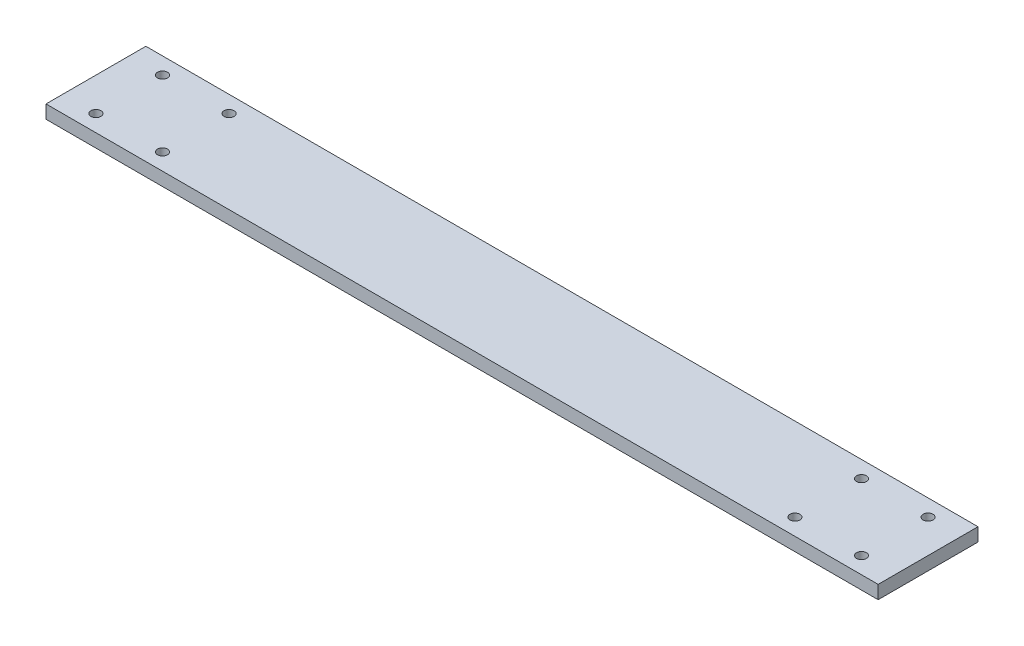
ISO-10303-21;
HEADER;
FILE_DESCRIPTION(('STEP AP214'),'2;1');
FILE_NAME('part.step','',(''),(''),'','','');
FILE_SCHEMA(('AUTOMOTIVE_DESIGN { 1 0 10303 214 1 1 1 1 }'));
ENDSEC;
DATA;
#1=APPLICATION_CONTEXT('core data for automotive mechanical design processes');
#2=APPLICATION_PROTOCOL_DEFINITION('international standard','automotive_design',2000,#1);
#3=PRODUCT_CONTEXT('',#1,'mechanical');
#4=PRODUCT('Part','Part','',(#3));
#5=PRODUCT_RELATED_PRODUCT_CATEGORY('part','',(#4));
#6=PRODUCT_DEFINITION_FORMATION('','',#4);
#7=PRODUCT_DEFINITION_CONTEXT('part definition',#1,'design');
#8=PRODUCT_DEFINITION('design','',#6,#7);
#9=PRODUCT_DEFINITION_SHAPE('','',#8);
#10=(LENGTH_UNIT() NAMED_UNIT(*) SI_UNIT(.MILLI.,.METRE.));
#11=(NAMED_UNIT(*) PLANE_ANGLE_UNIT() SI_UNIT($,.RADIAN.));
#12=(NAMED_UNIT(*) SI_UNIT($,.STERADIAN.) SOLID_ANGLE_UNIT());
#13=UNCERTAINTY_MEASURE_WITH_UNIT(LENGTH_MEASURE(1.E-05),#10,'distance_accuracy_value','');
#14=(GEOMETRIC_REPRESENTATION_CONTEXT(3) GLOBAL_UNCERTAINTY_ASSIGNED_CONTEXT((#13)) GLOBAL_UNIT_ASSIGNED_CONTEXT((#10,
#11,#12)) REPRESENTATION_CONTEXT('',''));
#15=CARTESIAN_POINT('',(0.,0.,0.));
#16=DIRECTION('',(0.,0.,1.));
#17=DIRECTION('',(1.,0.,0.));
#18=AXIS2_PLACEMENT_3D('',#15,#16,#17);
#19=CARTESIAN_POINT('',(0.,4.,0.));
#20=DIRECTION('',(0.,1.,0.));
#21=DIRECTION('',(0.,0.,1.));
#22=AXIS2_PLACEMENT_3D('',#19,#20,#21);
#23=PLANE('',#22);
#24=CARTESIAN_POINT('',(115.,4.,-10.));
#25=DIRECTION('',(0.,1.,0.));
#26=DIRECTION('',(0.,0.,-1.));
#27=AXIS2_PLACEMENT_3D('',#24,#25,#26);
#28=CIRCLE('',#27,1.5);
#29=CARTESIAN_POINT('',(115.,4.,-11.5));
#30=VERTEX_POINT('',#29);
#31=EDGE_CURVE('E145',#30,#30,#28,.T.);
#32=ORIENTED_EDGE('',*,*,#31,.F.);
#33=EDGE_LOOP('',(#32));
#34=FACE_BOUND('',#33,.T.);
#35=CARTESIAN_POINT('',(95.,4.,9.99999999999998));
#36=DIRECTION('',(0.,1.,0.));
#37=DIRECTION('',(0.,0.,-1.));
#38=AXIS2_PLACEMENT_3D('',#35,#36,#37);
#39=CIRCLE('',#38,1.5);
#40=CARTESIAN_POINT('',(95.,4.,8.49999999999998));
#41=VERTEX_POINT('',#40);
#42=EDGE_CURVE('E133',#41,#41,#39,.T.);
#43=ORIENTED_EDGE('',*,*,#42,.F.);
#44=EDGE_LOOP('',(#43));
#45=FACE_BOUND('',#44,.T.);
#46=CARTESIAN_POINT('',(-95.,4.,10.));
#47=DIRECTION('',(0.,1.,0.));
#48=DIRECTION('',(0.,0.,1.));
#49=AXIS2_PLACEMENT_3D('',#46,#47,#48);
#50=CIRCLE('',#49,1.5);
#51=CARTESIAN_POINT('',(-95.,4.,11.5));
#52=VERTEX_POINT('',#51);
#53=EDGE_CURVE('E121',#52,#52,#50,.T.);
#54=ORIENTED_EDGE('',*,*,#53,.F.);
#55=EDGE_LOOP('',(#54));
#56=FACE_BOUND('',#55,.T.);
#57=CARTESIAN_POINT('',(-115.,4.,-9.99999999999999));
#58=DIRECTION('',(0.,1.,0.));
#59=DIRECTION('',(0.,0.,1.));
#60=AXIS2_PLACEMENT_3D('',#57,#58,#59);
#61=CIRCLE('',#60,1.5);
#62=CARTESIAN_POINT('',(-115.,4.,-8.49999999999999));
#63=VERTEX_POINT('',#62);
#64=EDGE_CURVE('E100',#63,#63,#61,.T.);
#65=ORIENTED_EDGE('',*,*,#64,.F.);
#66=EDGE_LOOP('',(#65));
#67=FACE_BOUND('',#66,.T.);
#68=DIRECTION('',(0.,0.,1.));
#69=VECTOR('',#68,1.);
#70=CARTESIAN_POINT('',(-125.,4.,15.));
#71=LINE('',#70,#69);
#72=CARTESIAN_POINT('',(-125.,4.,-15.));
#73=VERTEX_POINT('',#72);
#74=CARTESIAN_POINT('',(-125.,4.,15.));
#75=VERTEX_POINT('',#74);
#76=EDGE_CURVE('E85',#73,#75,#71,.T.);
#77=ORIENTED_EDGE('',*,*,#76,.T.);
#78=DIRECTION('',(1.,0.,0.));
#79=VECTOR('',#78,1.);
#80=CARTESIAN_POINT('',(125.,4.,15.));
#81=LINE('',#80,#79);
#82=CARTESIAN_POINT('',(125.,4.,15.));
#83=VERTEX_POINT('',#82);
#84=EDGE_CURVE('E80',#75,#83,#81,.T.);
#85=ORIENTED_EDGE('',*,*,#84,.T.);
#86=DIRECTION('',(0.,0.,-1.));
#87=VECTOR('',#86,1.);
#88=CARTESIAN_POINT('',(125.,4.,15.));
#89=LINE('',#88,#87);
#90=CARTESIAN_POINT('',(125.,4.,-15.));
#91=VERTEX_POINT('',#90);
#92=EDGE_CURVE('E83',#83,#91,#89,.T.);
#93=ORIENTED_EDGE('',*,*,#92,.T.);
#94=DIRECTION('',(-1.,0.,0.));
#95=VECTOR('',#94,1.);
#96=CARTESIAN_POINT('',(125.,4.,-15.));
#97=LINE('',#96,#95);
#98=EDGE_CURVE('E50',#91,#73,#97,.T.);
#99=ORIENTED_EDGE('',*,*,#98,.T.);
#100=EDGE_LOOP('',(#77,#85,#93,#99));
#101=FACE_BOUND('',#100,.T.);
#102=CARTESIAN_POINT('',(-115.,4.,10.));
#103=DIRECTION('',(0.,1.,0.));
#104=DIRECTION('',(0.,0.,1.));
#105=AXIS2_PLACEMENT_3D('',#102,#103,#104);
#106=CIRCLE('',#105,1.5);
#107=CARTESIAN_POINT('',(-115.,4.,11.5));
#108=VERTEX_POINT('',#107);
#109=EDGE_CURVE('E115',#108,#108,#106,.T.);
#110=ORIENTED_EDGE('',*,*,#109,.F.);
#111=EDGE_LOOP('',(#110));
#112=FACE_BOUND('',#111,.T.);
#113=CARTESIAN_POINT('',(-95.,4.,-10.));
#114=DIRECTION('',(0.,1.,0.));
#115=DIRECTION('',(0.,0.,1.));
#116=AXIS2_PLACEMENT_3D('',#113,#114,#115);
#117=CIRCLE('',#116,1.5);
#118=CARTESIAN_POINT('',(-95.,4.,-8.5));
#119=VERTEX_POINT('',#118);
#120=EDGE_CURVE('E127',#119,#119,#117,.T.);
#121=ORIENTED_EDGE('',*,*,#120,.F.);
#122=EDGE_LOOP('',(#121));
#123=FACE_BOUND('',#122,.T.);
#124=CARTESIAN_POINT('',(115.,4.,9.99999999999998));
#125=DIRECTION('',(0.,1.,0.));
#126=DIRECTION('',(0.,0.,-1.));
#127=AXIS2_PLACEMENT_3D('',#124,#125,#126);
#128=CIRCLE('',#127,1.5);
#129=CARTESIAN_POINT('',(115.,4.,8.49999999999999));
#130=VERTEX_POINT('',#129);
#131=EDGE_CURVE('E139',#130,#130,#128,.T.);
#132=ORIENTED_EDGE('',*,*,#131,.F.);
#133=EDGE_LOOP('',(#132));
#134=FACE_BOUND('',#133,.T.);
#135=CARTESIAN_POINT('',(95.,4.,-10.));
#136=DIRECTION('',(0.,1.,0.));
#137=DIRECTION('',(0.,0.,-1.));
#138=AXIS2_PLACEMENT_3D('',#135,#136,#137);
#139=CIRCLE('',#138,1.5);
#140=CARTESIAN_POINT('',(95.,4.,-11.5));
#141=VERTEX_POINT('',#140);
#142=EDGE_CURVE('E151',#141,#141,#139,.T.);
#143=ORIENTED_EDGE('',*,*,#142,.F.);
#144=EDGE_LOOP('',(#143));
#145=FACE_BOUND('',#144,.T.);
#146=ADVANCED_FACE('F33',(#34,#45,#56,#67,#101,#112,#123,#134,#145),#23,.T.);
#147=CARTESIAN_POINT('',(0.,0.,0.));
#148=DIRECTION('',(0.,1.,0.));
#149=DIRECTION('',(0.,0.,1.));
#150=AXIS2_PLACEMENT_3D('',#147,#148,#149);
#151=PLANE('',#150);
#152=DIRECTION('',(0.,0.,1.));
#153=VECTOR('',#152,1.);
#154=CARTESIAN_POINT('',(-125.,0.,15.));
#155=LINE('',#154,#153);
#156=CARTESIAN_POINT('',(-125.,0.,-15.));
#157=VERTEX_POINT('',#156);
#158=CARTESIAN_POINT('',(-125.,0.,15.));
#159=VERTEX_POINT('',#158);
#160=EDGE_CURVE('E97',#157,#159,#155,.T.);
#161=ORIENTED_EDGE('',*,*,#160,.F.);
#162=DIRECTION('',(-1.,0.,0.));
#163=VECTOR('',#162,1.);
#164=CARTESIAN_POINT('',(125.,0.,-15.));
#165=LINE('',#164,#163);
#166=CARTESIAN_POINT('',(125.,0.,-15.));
#167=VERTEX_POINT('',#166);
#168=EDGE_CURVE('E73',#167,#157,#165,.T.);
#169=ORIENTED_EDGE('',*,*,#168,.F.);
#170=DIRECTION('',(0.,0.,-1.));
#171=VECTOR('',#170,1.);
#172=CARTESIAN_POINT('',(125.,0.,15.));
#173=LINE('',#172,#171);
#174=CARTESIAN_POINT('',(125.,0.,15.));
#175=VERTEX_POINT('',#174);
#176=EDGE_CURVE('E67',#175,#167,#173,.T.);
#177=ORIENTED_EDGE('',*,*,#176,.F.);
#178=DIRECTION('',(1.,0.,0.));
#179=VECTOR('',#178,1.);
#180=CARTESIAN_POINT('',(125.,0.,15.));
#181=LINE('',#180,#179);
#182=EDGE_CURVE('E89',#159,#175,#181,.T.);
#183=ORIENTED_EDGE('',*,*,#182,.F.);
#184=EDGE_LOOP('',(#161,#169,#177,#183));
#185=FACE_BOUND('',#184,.T.);
#186=CARTESIAN_POINT('',(-115.,0.,-9.99999999999999));
#187=DIRECTION('',(0.,1.,0.));
#188=DIRECTION('',(0.,0.,1.));
#189=AXIS2_PLACEMENT_3D('',#186,#187,#188);
#190=CIRCLE('',#189,1.5);
#191=CARTESIAN_POINT('',(-115.,0.,-8.49999999999999));
#192=VERTEX_POINT('',#191);
#193=EDGE_CURVE('E112',#192,#192,#190,.T.);
#194=ORIENTED_EDGE('',*,*,#193,.T.);
#195=EDGE_LOOP('',(#194));
#196=FACE_BOUND('',#195,.T.);
#197=CARTESIAN_POINT('',(-115.,0.,10.));
#198=DIRECTION('',(0.,1.,0.));
#199=DIRECTION('',(0.,0.,1.));
#200=AXIS2_PLACEMENT_3D('',#197,#198,#199);
#201=CIRCLE('',#200,1.5);
#202=CARTESIAN_POINT('',(-115.,0.,11.5));
#203=VERTEX_POINT('',#202);
#204=EDGE_CURVE('E118',#203,#203,#201,.T.);
#205=ORIENTED_EDGE('',*,*,#204,.T.);
#206=EDGE_LOOP('',(#205));
#207=FACE_BOUND('',#206,.T.);
#208=CARTESIAN_POINT('',(-95.,0.,10.));
#209=DIRECTION('',(0.,1.,0.));
#210=DIRECTION('',(0.,0.,1.));
#211=AXIS2_PLACEMENT_3D('',#208,#209,#210);
#212=CIRCLE('',#211,1.5);
#213=CARTESIAN_POINT('',(-95.,0.,11.5));
#214=VERTEX_POINT('',#213);
#215=EDGE_CURVE('E124',#214,#214,#212,.T.);
#216=ORIENTED_EDGE('',*,*,#215,.T.);
#217=EDGE_LOOP('',(#216));
#218=FACE_BOUND('',#217,.T.);
#219=CARTESIAN_POINT('',(-95.,0.,-10.));
#220=DIRECTION('',(0.,1.,0.));
#221=DIRECTION('',(0.,0.,1.));
#222=AXIS2_PLACEMENT_3D('',#219,#220,#221);
#223=CIRCLE('',#222,1.5);
#224=CARTESIAN_POINT('',(-95.,0.,-8.5));
#225=VERTEX_POINT('',#224);
#226=EDGE_CURVE('E130',#225,#225,#223,.T.);
#227=ORIENTED_EDGE('',*,*,#226,.T.);
#228=EDGE_LOOP('',(#227));
#229=FACE_BOUND('',#228,.T.);
#230=CARTESIAN_POINT('',(95.,0.,9.99999999999998));
#231=DIRECTION('',(0.,1.,0.));
#232=DIRECTION('',(0.,0.,-1.));
#233=AXIS2_PLACEMENT_3D('',#230,#231,#232);
#234=CIRCLE('',#233,1.5);
#235=CARTESIAN_POINT('',(95.,0.,8.49999999999998));
#236=VERTEX_POINT('',#235);
#237=EDGE_CURVE('E136',#236,#236,#234,.T.);
#238=ORIENTED_EDGE('',*,*,#237,.T.);
#239=EDGE_LOOP('',(#238));
#240=FACE_BOUND('',#239,.T.);
#241=CARTESIAN_POINT('',(115.,0.,9.99999999999998));
#242=DIRECTION('',(0.,1.,0.));
#243=DIRECTION('',(0.,0.,-1.));
#244=AXIS2_PLACEMENT_3D('',#241,#242,#243);
#245=CIRCLE('',#244,1.5);
#246=CARTESIAN_POINT('',(115.,0.,8.49999999999999));
#247=VERTEX_POINT('',#246);
#248=EDGE_CURVE('E142',#247,#247,#245,.T.);
#249=ORIENTED_EDGE('',*,*,#248,.T.);
#250=EDGE_LOOP('',(#249));
#251=FACE_BOUND('',#250,.T.);
#252=CARTESIAN_POINT('',(115.,0.,-10.));
#253=DIRECTION('',(0.,1.,0.));
#254=DIRECTION('',(0.,0.,-1.));
#255=AXIS2_PLACEMENT_3D('',#252,#253,#254);
#256=CIRCLE('',#255,1.5);
#257=CARTESIAN_POINT('',(115.,0.,-11.5));
#258=VERTEX_POINT('',#257);
#259=EDGE_CURVE('E148',#258,#258,#256,.T.);
#260=ORIENTED_EDGE('',*,*,#259,.T.);
#261=EDGE_LOOP('',(#260));
#262=FACE_BOUND('',#261,.T.);
#263=CARTESIAN_POINT('',(95.,0.,-10.));
#264=DIRECTION('',(0.,1.,0.));
#265=DIRECTION('',(0.,0.,-1.));
#266=AXIS2_PLACEMENT_3D('',#263,#264,#265);
#267=CIRCLE('',#266,1.5);
#268=CARTESIAN_POINT('',(95.,0.,-11.5));
#269=VERTEX_POINT('',#268);
#270=EDGE_CURVE('E154',#269,#269,#267,.T.);
#271=ORIENTED_EDGE('',*,*,#270,.T.);
#272=EDGE_LOOP('',(#271));
#273=FACE_BOUND('',#272,.T.);
#274=ADVANCED_FACE('F108',(#185,#196,#207,#218,#229,#240,#251,#262,#273),#151,.F.);
#275=CARTESIAN_POINT('',(-125.,4.,15.));
#276=DIRECTION('',(1.,0.,0.));
#277=DIRECTION('',(0.,0.,-1.));
#278=AXIS2_PLACEMENT_3D('',#275,#276,#277);
#279=PLANE('',#278);
#280=ORIENTED_EDGE('',*,*,#160,.T.);
#281=DIRECTION('',(0.,-1.,0.));
#282=VECTOR('',#281,1.);
#283=CARTESIAN_POINT('',(-125.,4.,15.));
#284=LINE('',#283,#282);
#285=EDGE_CURVE('E11',#75,#159,#284,.T.);
#286=ORIENTED_EDGE('',*,*,#285,.F.);
#287=ORIENTED_EDGE('',*,*,#76,.F.);
#288=DIRECTION('',(0.,-1.,0.));
#289=VECTOR('',#288,1.);
#290=CARTESIAN_POINT('',(-125.,4.,-15.));
#291=LINE('',#290,#289);
#292=EDGE_CURVE('E93',#73,#157,#291,.T.);
#293=ORIENTED_EDGE('',*,*,#292,.T.);
#294=EDGE_LOOP('',(#280,#286,#287,#293));
#295=FACE_BOUND('',#294,.T.);
#296=ADVANCED_FACE('F35',(#295),#279,.F.);
#297=CARTESIAN_POINT('',(125.,4.,15.));
#298=DIRECTION('',(0.,0.,-1.));
#299=DIRECTION('',(-1.,0.,0.));
#300=AXIS2_PLACEMENT_3D('',#297,#298,#299);
#301=PLANE('',#300);
#302=ORIENTED_EDGE('',*,*,#182,.T.);
#303=DIRECTION('',(0.,-1.,0.));
#304=VECTOR('',#303,1.);
#305=CARTESIAN_POINT('',(125.,4.,15.));
#306=LINE('',#305,#304);
#307=EDGE_CURVE('E42',#83,#175,#306,.T.);
#308=ORIENTED_EDGE('',*,*,#307,.F.);
#309=ORIENTED_EDGE('',*,*,#84,.F.);
#310=ORIENTED_EDGE('',*,*,#285,.T.);
#311=EDGE_LOOP('',(#302,#308,#309,#310));
#312=FACE_BOUND('',#311,.T.);
#313=ADVANCED_FACE('F88',(#312),#301,.F.);
#314=CARTESIAN_POINT('',(125.,4.,15.));
#315=DIRECTION('',(-1.,0.,0.));
#316=DIRECTION('',(0.,0.,1.));
#317=AXIS2_PLACEMENT_3D('',#314,#315,#316);
#318=PLANE('',#317);
#319=ORIENTED_EDGE('',*,*,#176,.T.);
#320=DIRECTION('',(0.,-1.,0.));
#321=VECTOR('',#320,1.);
#322=CARTESIAN_POINT('',(125.,4.,-15.));
#323=LINE('',#322,#321);
#324=EDGE_CURVE('E90',#91,#167,#323,.T.);
#325=ORIENTED_EDGE('',*,*,#324,.F.);
#326=ORIENTED_EDGE('',*,*,#92,.F.);
#327=ORIENTED_EDGE('',*,*,#307,.T.);
#328=EDGE_LOOP('',(#319,#325,#326,#327));
#329=FACE_BOUND('',#328,.T.);
#330=ADVANCED_FACE('F91',(#329),#318,.F.);
#331=CARTESIAN_POINT('',(125.,4.,-15.));
#332=DIRECTION('',(0.,0.,1.));
#333=DIRECTION('',(1.,0.,0.));
#334=AXIS2_PLACEMENT_3D('',#331,#332,#333);
#335=PLANE('',#334);
#336=ORIENTED_EDGE('',*,*,#168,.T.);
#337=ORIENTED_EDGE('',*,*,#292,.F.);
#338=ORIENTED_EDGE('',*,*,#98,.F.);
#339=ORIENTED_EDGE('',*,*,#324,.T.);
#340=EDGE_LOOP('',(#336,#337,#338,#339));
#341=FACE_BOUND('',#340,.T.);
#342=ADVANCED_FACE('F105',(#341),#335,.F.);
#343=CARTESIAN_POINT('',(-115.,4.,-9.99999999999999));
#344=DIRECTION('',(0.,-1.,0.));
#345=DIRECTION('',(0.,0.,-1.));
#346=AXIS2_PLACEMENT_3D('',#343,#344,#345);
#347=CYLINDRICAL_SURFACE('',#346,1.5);
#348=ORIENTED_EDGE('',*,*,#64,.T.);
#349=EDGE_LOOP('',(#348));
#350=FACE_BOUND('',#349,.T.);
#351=ORIENTED_EDGE('',*,*,#193,.F.);
#352=EDGE_LOOP('',(#351));
#353=FACE_BOUND('',#352,.T.);
#354=ADVANCED_FACE('F173',(#350,#353),#347,.F.);
#355=CARTESIAN_POINT('',(-115.,4.,10.));
#356=DIRECTION('',(0.,-1.,0.));
#357=DIRECTION('',(0.,0.,-1.));
#358=AXIS2_PLACEMENT_3D('',#355,#356,#357);
#359=CYLINDRICAL_SURFACE('',#358,1.5);
#360=ORIENTED_EDGE('',*,*,#109,.T.);
#361=EDGE_LOOP('',(#360));
#362=FACE_BOUND('',#361,.T.);
#363=ORIENTED_EDGE('',*,*,#204,.F.);
#364=EDGE_LOOP('',(#363));
#365=FACE_BOUND('',#364,.T.);
#366=ADVANCED_FACE('F219',(#362,#365),#359,.F.);
#367=CARTESIAN_POINT('',(-95.,4.,10.));
#368=DIRECTION('',(0.,-1.,0.));
#369=DIRECTION('',(0.,0.,-1.));
#370=AXIS2_PLACEMENT_3D('',#367,#368,#369);
#371=CYLINDRICAL_SURFACE('',#370,1.5);
#372=ORIENTED_EDGE('',*,*,#53,.T.);
#373=EDGE_LOOP('',(#372));
#374=FACE_BOUND('',#373,.T.);
#375=ORIENTED_EDGE('',*,*,#215,.F.);
#376=EDGE_LOOP('',(#375));
#377=FACE_BOUND('',#376,.T.);
#378=ADVANCED_FACE('F227',(#374,#377),#371,.F.);
#379=CARTESIAN_POINT('',(-95.,4.,-10.));
#380=DIRECTION('',(0.,-1.,0.));
#381=DIRECTION('',(0.,0.,-1.));
#382=AXIS2_PLACEMENT_3D('',#379,#380,#381);
#383=CYLINDRICAL_SURFACE('',#382,1.5);
#384=ORIENTED_EDGE('',*,*,#120,.T.);
#385=EDGE_LOOP('',(#384));
#386=FACE_BOUND('',#385,.T.);
#387=ORIENTED_EDGE('',*,*,#226,.F.);
#388=EDGE_LOOP('',(#387));
#389=FACE_BOUND('',#388,.T.);
#390=ADVANCED_FACE('F235',(#386,#389),#383,.F.);
#391=CARTESIAN_POINT('',(95.,4.,9.99999999999998));
#392=DIRECTION('',(0.,-1.,0.));
#393=DIRECTION('',(0.,0.,-1.));
#394=AXIS2_PLACEMENT_3D('',#391,#392,#393);
#395=CYLINDRICAL_SURFACE('',#394,1.5);
#396=ORIENTED_EDGE('',*,*,#42,.T.);
#397=EDGE_LOOP('',(#396));
#398=FACE_BOUND('',#397,.T.);
#399=ORIENTED_EDGE('',*,*,#237,.F.);
#400=EDGE_LOOP('',(#399));
#401=FACE_BOUND('',#400,.T.);
#402=ADVANCED_FACE('F244',(#398,#401),#395,.F.);
#403=CARTESIAN_POINT('',(115.,4.,9.99999999999998));
#404=DIRECTION('',(0.,-1.,0.));
#405=DIRECTION('',(0.,0.,-1.));
#406=AXIS2_PLACEMENT_3D('',#403,#404,#405);
#407=CYLINDRICAL_SURFACE('',#406,1.5);
#408=ORIENTED_EDGE('',*,*,#131,.T.);
#409=EDGE_LOOP('',(#408));
#410=FACE_BOUND('',#409,.T.);
#411=ORIENTED_EDGE('',*,*,#248,.F.);
#412=EDGE_LOOP('',(#411));
#413=FACE_BOUND('',#412,.T.);
#414=ADVANCED_FACE('F253',(#410,#413),#407,.F.);
#415=CARTESIAN_POINT('',(115.,4.,-10.));
#416=DIRECTION('',(0.,-1.,0.));
#417=DIRECTION('',(0.,0.,-1.));
#418=AXIS2_PLACEMENT_3D('',#415,#416,#417);
#419=CYLINDRICAL_SURFACE('',#418,1.5);
#420=ORIENTED_EDGE('',*,*,#31,.T.);
#421=EDGE_LOOP('',(#420));
#422=FACE_BOUND('',#421,.T.);
#423=ORIENTED_EDGE('',*,*,#259,.F.);
#424=EDGE_LOOP('',(#423));
#425=FACE_BOUND('',#424,.T.);
#426=ADVANCED_FACE('F262',(#422,#425),#419,.F.);
#427=CARTESIAN_POINT('',(95.,4.,-10.));
#428=DIRECTION('',(0.,-1.,0.));
#429=DIRECTION('',(0.,0.,-1.));
#430=AXIS2_PLACEMENT_3D('',#427,#428,#429);
#431=CYLINDRICAL_SURFACE('',#430,1.5);
#432=ORIENTED_EDGE('',*,*,#142,.T.);
#433=EDGE_LOOP('',(#432));
#434=FACE_BOUND('',#433,.T.);
#435=ORIENTED_EDGE('',*,*,#270,.F.);
#436=EDGE_LOOP('',(#435));
#437=FACE_BOUND('',#436,.T.);
#438=ADVANCED_FACE('F160',(#434,#437),#431,.F.);
#439=CLOSED_SHELL('',(#146,#274,#296,#313,#330,#342,#354,#366,#378,#390,#402,#414,#426,#438));
#440=MANIFOLD_SOLID_BREP('B2',#439);
#441=ADVANCED_BREP_SHAPE_REPRESENTATION('',(#18,#440),#14);
#442=SHAPE_DEFINITION_REPRESENTATION(#9,#441);
ENDSEC;
END-ISO-10303-21;
